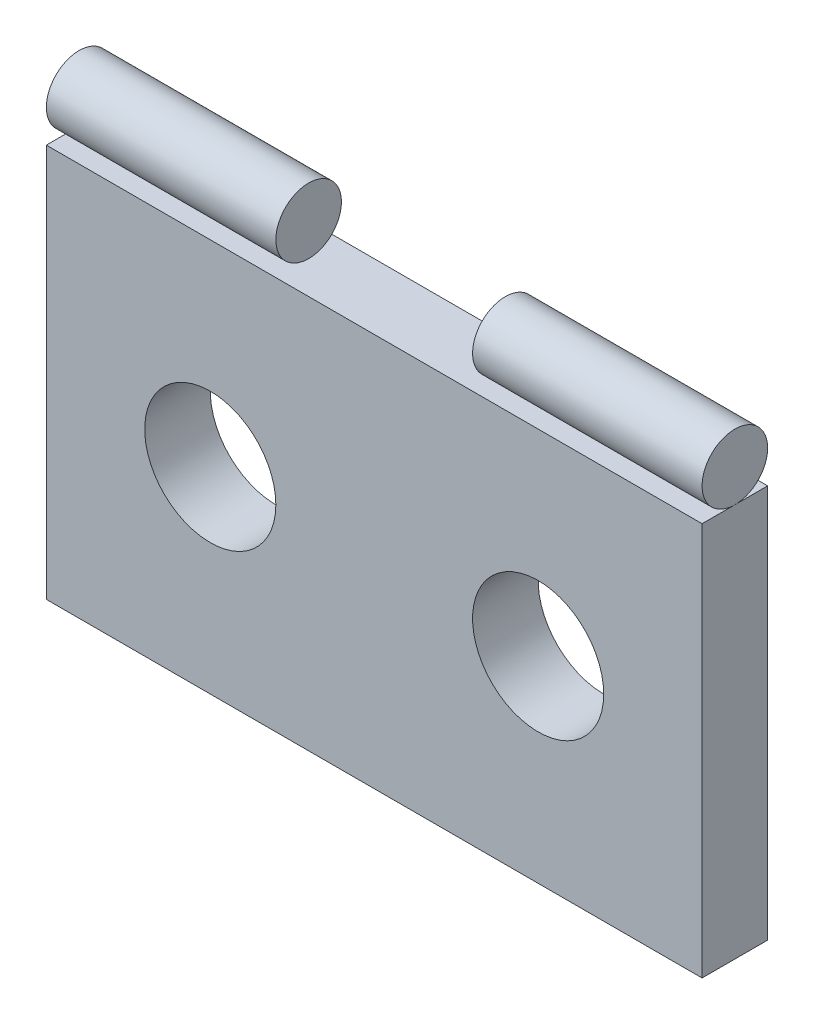
ISO-10303-21;
HEADER;
FILE_DESCRIPTION(('STEP AP214'),'2;1');
FILE_NAME('part.step','',(''),(''),'','','');
FILE_SCHEMA(('AUTOMOTIVE_DESIGN { 1 0 10303 214 1 1 1 1 }'));
ENDSEC;
DATA;
#1=APPLICATION_CONTEXT('core data for automotive mechanical design processes');
#2=APPLICATION_PROTOCOL_DEFINITION('international standard','automotive_design',2000,#1);
#3=PRODUCT_CONTEXT('',#1,'mechanical');
#4=PRODUCT('Part','Part','',(#3));
#5=PRODUCT_RELATED_PRODUCT_CATEGORY('part','',(#4));
#6=PRODUCT_DEFINITION_FORMATION('','',#4);
#7=PRODUCT_DEFINITION_CONTEXT('part definition',#1,'design');
#8=PRODUCT_DEFINITION('design','',#6,#7);
#9=PRODUCT_DEFINITION_SHAPE('','',#8);
#10=(LENGTH_UNIT() NAMED_UNIT(*) SI_UNIT(.MILLI.,.METRE.));
#11=(NAMED_UNIT(*) PLANE_ANGLE_UNIT() SI_UNIT($,.RADIAN.));
#12=(NAMED_UNIT(*) SI_UNIT($,.STERADIAN.) SOLID_ANGLE_UNIT());
#13=UNCERTAINTY_MEASURE_WITH_UNIT(LENGTH_MEASURE(1.E-05),#10,'distance_accuracy_value','');
#14=(GEOMETRIC_REPRESENTATION_CONTEXT(3) GLOBAL_UNCERTAINTY_ASSIGNED_CONTEXT((#13)) GLOBAL_UNIT_ASSIGNED_CONTEXT((#10,
#11,#12)) REPRESENTATION_CONTEXT('',''));
#15=CARTESIAN_POINT('',(0.,0.,0.));
#16=DIRECTION('',(0.,0.,1.));
#17=DIRECTION('',(1.,0.,0.));
#18=AXIS2_PLACEMENT_3D('',#15,#16,#17);
#19=CARTESIAN_POINT('',(0.,32.5,2.5));
#20=DIRECTION('',(1.,0.,0.));
#21=DIRECTION('',(0.,0.,-1.));
#22=AXIS2_PLACEMENT_3D('',#19,#20,#21);
#23=CYLINDRICAL_SURFACE('',#22,2.5);
#24=CARTESIAN_POINT('',(0.,32.5,2.5));
#25=DIRECTION('',(1.,0.,0.));
#26=DIRECTION('',(0.,0.,-1.));
#27=AXIS2_PLACEMENT_3D('',#24,#25,#26);
#28=CIRCLE('',#27,2.5);
#29=CARTESIAN_POINT('',(0.,32.5,0.));
#30=VERTEX_POINT('',#29);
#31=EDGE_CURVE('E43',#30,#30,#28,.T.);
#32=ORIENTED_EDGE('',*,*,#31,.T.);
#33=EDGE_LOOP('',(#32));
#34=FACE_BOUND('',#33,.T.);
#35=CARTESIAN_POINT('',(17.5,32.5,2.5));
#36=DIRECTION('',(1.,0.,0.));
#37=DIRECTION('',(0.,0.,-1.));
#38=AXIS2_PLACEMENT_3D('',#35,#36,#37);
#39=CIRCLE('',#38,2.5);
#40=CARTESIAN_POINT('',(17.5,32.5,0.));
#41=VERTEX_POINT('',#40);
#42=EDGE_CURVE('E11',#41,#41,#39,.F.);
#43=ORIENTED_EDGE('',*,*,#42,.T.);
#44=EDGE_LOOP('',(#43));
#45=FACE_BOUND('',#44,.T.);
#46=ADVANCED_FACE('F40',(#34,#45),#23,.T.);
#47=CARTESIAN_POINT('',(0.,32.5,2.5));
#48=DIRECTION('',(1.,0.,0.));
#49=DIRECTION('',(0.,0.,-1.));
#50=AXIS2_PLACEMENT_3D('',#47,#48,#49);
#51=PLANE('',#50);
#52=ORIENTED_EDGE('',*,*,#31,.F.);
#53=EDGE_LOOP('',(#52));
#54=FACE_BOUND('',#53,.T.);
#55=ADVANCED_FACE('F53',(#54),#51,.F.);
#56=CARTESIAN_POINT('',(17.5,30.,55.));
#57=DIRECTION('',(1.,0.,0.));
#58=DIRECTION('',(0.,0.,-1.));
#59=AXIS2_PLACEMENT_3D('',#56,#57,#58);
#60=PLANE('',#59);
#61=ORIENTED_EDGE('',*,*,#42,.F.);
#62=EDGE_LOOP('',(#61));
#63=FACE_BOUND('',#62,.T.);
#64=ADVANCED_FACE('F55',(#63),#60,.T.);
#65=CLOSED_SHELL('',(#46,#55,#64));
#66=MANIFOLD_SOLID_BREP('B2',#65);
#67=CARTESIAN_POINT('',(50.,32.5,2.5));
#68=DIRECTION('',(1.,0.,0.));
#69=DIRECTION('',(0.,0.,-1.));
#70=AXIS2_PLACEMENT_3D('',#67,#68,#69);
#71=PLANE('',#70);
#72=CARTESIAN_POINT('',(50.,32.5,2.5));
#73=DIRECTION('',(1.,0.,0.));
#74=DIRECTION('',(0.,0.,-1.));
#75=AXIS2_PLACEMENT_3D('',#72,#73,#74);
#76=CIRCLE('',#75,2.5);
#77=CARTESIAN_POINT('',(50.,32.5,0.));
#78=VERTEX_POINT('',#77);
#79=EDGE_CURVE('E97',#78,#78,#76,.T.);
#80=ORIENTED_EDGE('',*,*,#79,.T.);
#81=EDGE_LOOP('',(#80));
#82=FACE_BOUND('',#81,.T.);
#83=ADVANCED_FACE('F90',(#82),#71,.T.);
#84=CARTESIAN_POINT('',(0.,32.5,2.5));
#85=DIRECTION('',(1.,0.,0.));
#86=DIRECTION('',(0.,0.,-1.));
#87=AXIS2_PLACEMENT_3D('',#84,#85,#86);
#88=CYLINDRICAL_SURFACE('',#87,2.5);
#89=ORIENTED_EDGE('',*,*,#79,.F.);
#90=EDGE_LOOP('',(#89));
#91=FACE_BOUND('',#90,.T.);
#92=CARTESIAN_POINT('',(32.5,32.5,2.5));
#93=DIRECTION('',(-1.,0.,0.));
#94=DIRECTION('',(0.,0.,1.));
#95=AXIS2_PLACEMENT_3D('',#92,#93,#94);
#96=CIRCLE('',#95,2.5);
#97=CARTESIAN_POINT('',(32.5,32.5,5.));
#98=VERTEX_POINT('',#97);
#99=EDGE_CURVE('E39',#98,#98,#96,.F.);
#100=ORIENTED_EDGE('',*,*,#99,.T.);
#101=EDGE_LOOP('',(#100));
#102=FACE_BOUND('',#101,.T.);
#103=ADVANCED_FACE('F92',(#91,#102),#88,.T.);
#104=CARTESIAN_POINT('',(32.5,30.,55.));
#105=DIRECTION('',(-1.,0.,0.));
#106=DIRECTION('',(0.,0.,1.));
#107=AXIS2_PLACEMENT_3D('',#104,#105,#106);
#108=PLANE('',#107);
#109=ORIENTED_EDGE('',*,*,#99,.F.);
#110=EDGE_LOOP('',(#109));
#111=FACE_BOUND('',#110,.T.);
#112=ADVANCED_FACE('F105',(#111),#108,.T.);
#113=CLOSED_SHELL('',(#83,#103,#112));
#114=MANIFOLD_SOLID_BREP('B6',#113);
#115=CARTESIAN_POINT('',(0.,0.,5.));
#116=DIRECTION('',(1.,0.,0.));
#117=DIRECTION('',(0.,0.,-1.));
#118=AXIS2_PLACEMENT_3D('',#115,#116,#117);
#119=PLANE('',#118);
#120=DIRECTION('',(0.,-1.,0.));
#121=VECTOR('',#120,1.);
#122=CARTESIAN_POINT('',(0.,0.,0.));
#123=LINE('',#122,#121);
#124=CARTESIAN_POINT('',(0.,30.,0.));
#125=VERTEX_POINT('',#124);
#126=CARTESIAN_POINT('',(0.,0.,0.));
#127=VERTEX_POINT('',#126);
#128=EDGE_CURVE('E194',#125,#127,#123,.T.);
#129=ORIENTED_EDGE('',*,*,#128,.T.);
#130=DIRECTION('',(0.,0.,-1.));
#131=VECTOR('',#130,1.);
#132=CARTESIAN_POINT('',(0.,0.,5.));
#133=LINE('',#132,#131);
#134=CARTESIAN_POINT('',(0.,0.,5.));
#135=VERTEX_POINT('',#134);
#136=EDGE_CURVE('E88',#135,#127,#133,.T.);
#137=ORIENTED_EDGE('',*,*,#136,.F.);
#138=DIRECTION('',(0.,-1.,0.));
#139=VECTOR('',#138,1.);
#140=CARTESIAN_POINT('',(0.,0.,5.));
#141=LINE('',#140,#139);
#142=CARTESIAN_POINT('',(0.,30.,5.));
#143=VERTEX_POINT('',#142);
#144=EDGE_CURVE('E182',#143,#135,#141,.T.);
#145=ORIENTED_EDGE('',*,*,#144,.F.);
#146=DIRECTION('',(0.,0.,-1.));
#147=VECTOR('',#146,1.);
#148=CARTESIAN_POINT('',(0.,30.,5.));
#149=LINE('',#148,#147);
#150=EDGE_CURVE('E190',#143,#125,#149,.T.);
#151=ORIENTED_EDGE('',*,*,#150,.T.);
#152=EDGE_LOOP('',(#129,#137,#145,#151));
#153=FACE_BOUND('',#152,.T.);
#154=ADVANCED_FACE('F131',(#153),#119,.F.);
#155=CARTESIAN_POINT('',(0.,0.,5.));
#156=DIRECTION('',(0.,1.,0.));
#157=DIRECTION('',(0.,0.,1.));
#158=AXIS2_PLACEMENT_3D('',#155,#156,#157);
#159=PLANE('',#158);
#160=DIRECTION('',(1.,0.,0.));
#161=VECTOR('',#160,1.);
#162=CARTESIAN_POINT('',(0.,0.,0.));
#163=LINE('',#162,#161);
#164=CARTESIAN_POINT('',(50.,0.,0.));
#165=VERTEX_POINT('',#164);
#166=EDGE_CURVE('E186',#127,#165,#163,.T.);
#167=ORIENTED_EDGE('',*,*,#166,.T.);
#168=DIRECTION('',(0.,0.,-1.));
#169=VECTOR('',#168,1.);
#170=CARTESIAN_POINT('',(50.,0.,5.));
#171=LINE('',#170,#169);
#172=CARTESIAN_POINT('',(50.,0.,5.));
#173=VERTEX_POINT('',#172);
#174=EDGE_CURVE('E139',#173,#165,#171,.T.);
#175=ORIENTED_EDGE('',*,*,#174,.F.);
#176=DIRECTION('',(1.,0.,0.));
#177=VECTOR('',#176,1.);
#178=CARTESIAN_POINT('',(0.,0.,5.));
#179=LINE('',#178,#177);
#180=EDGE_CURVE('E177',#135,#173,#179,.T.);
#181=ORIENTED_EDGE('',*,*,#180,.F.);
#182=ORIENTED_EDGE('',*,*,#136,.T.);
#183=EDGE_LOOP('',(#167,#175,#181,#182));
#184=FACE_BOUND('',#183,.T.);
#185=ADVANCED_FACE('F185',(#184),#159,.F.);
#186=CARTESIAN_POINT('',(50.,0.,5.));
#187=DIRECTION('',(-1.,0.,0.));
#188=DIRECTION('',(0.,0.,1.));
#189=AXIS2_PLACEMENT_3D('',#186,#187,#188);
#190=PLANE('',#189);
#191=DIRECTION('',(0.,1.,0.));
#192=VECTOR('',#191,1.);
#193=CARTESIAN_POINT('',(50.,0.,0.));
#194=LINE('',#193,#192);
#195=CARTESIAN_POINT('',(50.,30.,0.));
#196=VERTEX_POINT('',#195);
#197=EDGE_CURVE('E164',#165,#196,#194,.T.);
#198=ORIENTED_EDGE('',*,*,#197,.T.);
#199=DIRECTION('',(0.,0.,-1.));
#200=VECTOR('',#199,1.);
#201=CARTESIAN_POINT('',(50.,30.,5.));
#202=LINE('',#201,#200);
#203=CARTESIAN_POINT('',(50.,30.,5.));
#204=VERTEX_POINT('',#203);
#205=EDGE_CURVE('E187',#204,#196,#202,.T.);
#206=ORIENTED_EDGE('',*,*,#205,.F.);
#207=DIRECTION('',(0.,1.,0.));
#208=VECTOR('',#207,1.);
#209=CARTESIAN_POINT('',(50.,0.,5.));
#210=LINE('',#209,#208);
#211=EDGE_CURVE('E180',#173,#204,#210,.T.);
#212=ORIENTED_EDGE('',*,*,#211,.F.);
#213=ORIENTED_EDGE('',*,*,#174,.T.);
#214=EDGE_LOOP('',(#198,#206,#212,#213));
#215=FACE_BOUND('',#214,.T.);
#216=ADVANCED_FACE('F188',(#215),#190,.F.);
#217=CARTESIAN_POINT('',(0.,30.,5.));
#218=DIRECTION('',(0.,-1.,0.));
#219=DIRECTION('',(0.,0.,-1.));
#220=AXIS2_PLACEMENT_3D('',#217,#218,#219);
#221=PLANE('',#220);
#222=DIRECTION('',(-1.,0.,0.));
#223=VECTOR('',#222,1.);
#224=CARTESIAN_POINT('',(0.,30.,0.));
#225=LINE('',#224,#223);
#226=EDGE_CURVE('E170',#196,#125,#225,.T.);
#227=ORIENTED_EDGE('',*,*,#226,.T.);
#228=ORIENTED_EDGE('',*,*,#150,.F.);
#229=DIRECTION('',(-1.,0.,0.));
#230=VECTOR('',#229,1.);
#231=CARTESIAN_POINT('',(0.,30.,5.));
#232=LINE('',#231,#230);
#233=EDGE_CURVE('E147',#204,#143,#232,.T.);
#234=ORIENTED_EDGE('',*,*,#233,.F.);
#235=ORIENTED_EDGE('',*,*,#205,.T.);
#236=EDGE_LOOP('',(#227,#228,#234,#235));
#237=FACE_BOUND('',#236,.T.);
#238=ADVANCED_FACE('F202',(#237),#221,.F.);
#239=CARTESIAN_POINT('',(0.,30.,5.));
#240=DIRECTION('',(0.,0.,-1.));
#241=DIRECTION('',(-1.,0.,0.));
#242=AXIS2_PLACEMENT_3D('',#239,#240,#241);
#243=PLANE('',#242);
#244=CARTESIAN_POINT('',(37.5,15.,5.));
#245=DIRECTION('',(0.,0.,1.));
#246=DIRECTION('',(1.,0.,0.));
#247=AXIS2_PLACEMENT_3D('',#244,#245,#246);
#248=CIRCLE('',#247,5.);
#249=CARTESIAN_POINT('',(42.5,15.,5.));
#250=VERTEX_POINT('',#249);
#251=EDGE_CURVE('E214',#250,#250,#248,.T.);
#252=ORIENTED_EDGE('',*,*,#251,.F.);
#253=EDGE_LOOP('',(#252));
#254=FACE_BOUND('',#253,.T.);
#255=CARTESIAN_POINT('',(12.5,15.,5.));
#256=DIRECTION('',(0.,0.,1.));
#257=DIRECTION('',(1.,0.,0.));
#258=AXIS2_PLACEMENT_3D('',#255,#256,#257);
#259=CIRCLE('',#258,5.);
#260=CARTESIAN_POINT('',(17.5,15.,5.));
#261=VERTEX_POINT('',#260);
#262=EDGE_CURVE('E208',#261,#261,#259,.T.);
#263=ORIENTED_EDGE('',*,*,#262,.F.);
#264=EDGE_LOOP('',(#263));
#265=FACE_BOUND('',#264,.T.);
#266=ORIENTED_EDGE('',*,*,#144,.T.);
#267=ORIENTED_EDGE('',*,*,#180,.T.);
#268=ORIENTED_EDGE('',*,*,#211,.T.);
#269=ORIENTED_EDGE('',*,*,#233,.T.);
#270=EDGE_LOOP('',(#266,#267,#268,#269));
#271=FACE_BOUND('',#270,.T.);
#272=ADVANCED_FACE('F178',(#254,#265,#271),#243,.F.);
#273=CARTESIAN_POINT('',(0.,30.,0.));
#274=DIRECTION('',(0.,0.,-1.));
#275=DIRECTION('',(-1.,0.,0.));
#276=AXIS2_PLACEMENT_3D('',#273,#274,#275);
#277=PLANE('',#276);
#278=CARTESIAN_POINT('',(37.5,15.,0.));
#279=DIRECTION('',(0.,0.,1.));
#280=DIRECTION('',(1.,0.,0.));
#281=AXIS2_PLACEMENT_3D('',#278,#279,#280);
#282=CIRCLE('',#281,5.);
#283=CARTESIAN_POINT('',(42.5,15.,0.));
#284=VERTEX_POINT('',#283);
#285=EDGE_CURVE('E211',#284,#284,#282,.T.);
#286=ORIENTED_EDGE('',*,*,#285,.T.);
#287=EDGE_LOOP('',(#286));
#288=FACE_BOUND('',#287,.T.);
#289=CARTESIAN_POINT('',(12.5,15.,0.));
#290=DIRECTION('',(0.,0.,1.));
#291=DIRECTION('',(1.,0.,0.));
#292=AXIS2_PLACEMENT_3D('',#289,#290,#291);
#293=CIRCLE('',#292,5.);
#294=CARTESIAN_POINT('',(17.5,15.,0.));
#295=VERTEX_POINT('',#294);
#296=EDGE_CURVE('E197',#295,#295,#293,.T.);
#297=ORIENTED_EDGE('',*,*,#296,.T.);
#298=EDGE_LOOP('',(#297));
#299=FACE_BOUND('',#298,.T.);
#300=ORIENTED_EDGE('',*,*,#128,.F.);
#301=ORIENTED_EDGE('',*,*,#226,.F.);
#302=ORIENTED_EDGE('',*,*,#197,.F.);
#303=ORIENTED_EDGE('',*,*,#166,.F.);
#304=EDGE_LOOP('',(#300,#301,#302,#303));
#305=FACE_BOUND('',#304,.T.);
#306=ADVANCED_FACE('F205',(#288,#299,#305),#277,.T.);
#307=CARTESIAN_POINT('',(12.5,15.,0.));
#308=DIRECTION('',(0.,0.,1.));
#309=DIRECTION('',(1.,0.,0.));
#310=AXIS2_PLACEMENT_3D('',#307,#308,#309);
#311=CYLINDRICAL_SURFACE('',#310,5.);
#312=ORIENTED_EDGE('',*,*,#296,.F.);
#313=EDGE_LOOP('',(#312));
#314=FACE_BOUND('',#313,.T.);
#315=ORIENTED_EDGE('',*,*,#262,.T.);
#316=EDGE_LOOP('',(#315));
#317=FACE_BOUND('',#316,.T.);
#318=ADVANCED_FACE('F225',(#314,#317),#311,.F.);
#319=CARTESIAN_POINT('',(37.5,15.,0.));
#320=DIRECTION('',(0.,0.,1.));
#321=DIRECTION('',(1.,0.,0.));
#322=AXIS2_PLACEMENT_3D('',#319,#320,#321);
#323=CYLINDRICAL_SURFACE('',#322,5.);
#324=ORIENTED_EDGE('',*,*,#285,.F.);
#325=EDGE_LOOP('',(#324));
#326=FACE_BOUND('',#325,.T.);
#327=ORIENTED_EDGE('',*,*,#251,.T.);
#328=EDGE_LOOP('',(#327));
#329=FACE_BOUND('',#328,.T.);
#330=ADVANCED_FACE('F222',(#326,#329),#323,.F.);
#331=CLOSED_SHELL('',(#154,#185,#216,#238,#272,#306,#318,#330));
#332=MANIFOLD_SOLID_BREP('B34',#331);
#333=ADVANCED_BREP_SHAPE_REPRESENTATION('',(#18,#66,#114,#332),#14);
#334=SHAPE_DEFINITION_REPRESENTATION(#9,#333);
ENDSEC;
END-ISO-10303-21;
